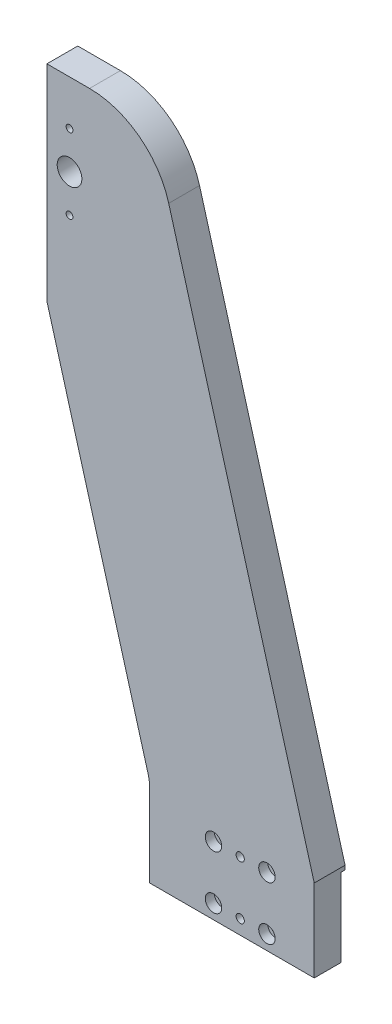
ISO-10303-21;
HEADER;
FILE_DESCRIPTION(('STEP AP214'),'2;1');
FILE_NAME('part.step','',(''),(''),'','','');
FILE_SCHEMA(('AUTOMOTIVE_DESIGN { 1 0 10303 214 1 1 1 1 }'));
ENDSEC;
DATA;
#1=APPLICATION_CONTEXT('core data for automotive mechanical design processes');
#2=APPLICATION_PROTOCOL_DEFINITION('international standard','automotive_design',2000,#1);
#3=PRODUCT_CONTEXT('',#1,'mechanical');
#4=PRODUCT('Part','Part','',(#3));
#5=PRODUCT_RELATED_PRODUCT_CATEGORY('part','',(#4));
#6=PRODUCT_DEFINITION_FORMATION('','',#4);
#7=PRODUCT_DEFINITION_CONTEXT('part definition',#1,'design');
#8=PRODUCT_DEFINITION('design','',#6,#7);
#9=PRODUCT_DEFINITION_SHAPE('','',#8);
#10=(LENGTH_UNIT() NAMED_UNIT(*) SI_UNIT(.MILLI.,.METRE.));
#11=(NAMED_UNIT(*) PLANE_ANGLE_UNIT() SI_UNIT($,.RADIAN.));
#12=(NAMED_UNIT(*) SI_UNIT($,.STERADIAN.) SOLID_ANGLE_UNIT());
#13=UNCERTAINTY_MEASURE_WITH_UNIT(LENGTH_MEASURE(1.E-05),#10,'distance_accuracy_value','');
#14=(GEOMETRIC_REPRESENTATION_CONTEXT(3) GLOBAL_UNCERTAINTY_ASSIGNED_CONTEXT((#13)) GLOBAL_UNIT_ASSIGNED_CONTEXT((#10,
#11,#12)) REPRESENTATION_CONTEXT('',''));
#15=CARTESIAN_POINT('',(0.,0.,0.));
#16=DIRECTION('',(0.,0.,1.));
#17=DIRECTION('',(1.,0.,0.));
#18=AXIS2_PLACEMENT_3D('',#15,#16,#17);
#19=CARTESIAN_POINT('',(0.,0.,15.));
#20=DIRECTION('',(0.,1.,0.));
#21=DIRECTION('',(0.,0.,1.));
#22=AXIS2_PLACEMENT_3D('',#19,#20,#21);
#23=PLANE('',#22);
#24=DIRECTION('',(-1.,0.,0.));
#25=VECTOR('',#24,1.);
#26=CARTESIAN_POINT('',(0.,0.,2.));
#27=LINE('',#26,#25);
#28=CARTESIAN_POINT('',(80.,0.,2.));
#29=VERTEX_POINT('',#28);
#30=CARTESIAN_POINT('',(0.,0.,2.));
#31=VERTEX_POINT('',#30);
#32=EDGE_CURVE('E136',#29,#31,#27,.T.);
#33=ORIENTED_EDGE('',*,*,#32,.F.);
#34=DIRECTION('',(0.,0.,-1.));
#35=VECTOR('',#34,1.);
#36=CARTESIAN_POINT('',(80.,0.,15.));
#37=LINE('',#36,#35);
#38=CARTESIAN_POINT('',(80.,0.,15.));
#39=VERTEX_POINT('',#38);
#40=EDGE_CURVE('E133',#39,#29,#37,.T.);
#41=ORIENTED_EDGE('',*,*,#40,.F.);
#42=DIRECTION('',(1.,0.,0.));
#43=VECTOR('',#42,1.);
#44=CARTESIAN_POINT('',(0.,0.,15.));
#45=LINE('',#44,#43);
#46=CARTESIAN_POINT('',(0.,0.,15.));
#47=VERTEX_POINT('',#46);
#48=EDGE_CURVE('E119',#47,#39,#45,.T.);
#49=ORIENTED_EDGE('',*,*,#48,.F.);
#50=DIRECTION('',(0.,0.,-1.));
#51=VECTOR('',#50,1.);
#52=CARTESIAN_POINT('',(0.,0.,15.));
#53=LINE('',#52,#51);
#54=EDGE_CURVE('E139',#47,#31,#53,.T.);
#55=ORIENTED_EDGE('',*,*,#54,.T.);
#56=EDGE_LOOP('',(#33,#41,#49,#55));
#57=FACE_BOUND('',#56,.T.);
#58=ADVANCED_FACE('F37',(#57),#23,.F.);
#59=CARTESIAN_POINT('',(-29.268839302064,280.,15.));
#60=DIRECTION('',(0.,0.,-1.));
#61=DIRECTION('',(-1.,0.,0.));
#62=AXIS2_PLACEMENT_3D('',#59,#60,#61);
#63=CYLINDRICAL_SURFACE('',#62,40.);
#64=CARTESIAN_POINT('',(-29.268839302064,280.,0.));
#65=DIRECTION('',(0.,0.,1.));
#66=DIRECTION('',(1.,0.,0.));
#67=AXIS2_PLACEMENT_3D('',#64,#65,#66);
#68=CIRCLE('',#67,40.);
#69=CARTESIAN_POINT('',(9.22850948471156,290.86066924224,0.));
#70=VERTEX_POINT('',#69);
#71=CARTESIAN_POINT('',(-29.268839302064,320.,0.));
#72=VERTEX_POINT('',#71);
#73=EDGE_CURVE('E148',#70,#72,#68,.T.);
#74=ORIENTED_EDGE('',*,*,#73,.T.);
#75=DIRECTION('',(0.,0.,-1.));
#76=VECTOR('',#75,1.);
#77=CARTESIAN_POINT('',(-29.268839302064,320.,15.));
#78=LINE('',#77,#76);
#79=CARTESIAN_POINT('',(-29.268839302064,320.,15.));
#80=VERTEX_POINT('',#79);
#81=EDGE_CURVE('E11',#80,#72,#78,.T.);
#82=ORIENTED_EDGE('',*,*,#81,.F.);
#83=CARTESIAN_POINT('',(-29.268839302064,280.,15.));
#84=DIRECTION('',(0.,0.,1.));
#85=DIRECTION('',(1.,0.,0.));
#86=AXIS2_PLACEMENT_3D('',#83,#84,#85);
#87=CIRCLE('',#86,40.);
#88=CARTESIAN_POINT('',(9.22850948471156,290.86066924224,15.));
#89=VERTEX_POINT('',#88);
#90=EDGE_CURVE('E166',#89,#80,#87,.T.);
#91=ORIENTED_EDGE('',*,*,#90,.F.);
#92=DIRECTION('',(0.,0.,-1.));
#93=VECTOR('',#92,1.);
#94=CARTESIAN_POINT('',(9.22850948471156,290.86066924224,15.));
#95=LINE('',#94,#93);
#96=EDGE_CURVE('E144',#89,#70,#95,.T.);
#97=ORIENTED_EDGE('',*,*,#96,.T.);
#98=EDGE_LOOP('',(#74,#82,#91,#97));
#99=FACE_BOUND('',#98,.T.);
#100=ADVANCED_FACE('F39',(#99),#63,.T.);
#101=CARTESIAN_POINT('',(-50.,320.,15.));
#102=DIRECTION('',(0.,-1.,0.));
#103=DIRECTION('',(1.,0.,0.));
#104=AXIS2_PLACEMENT_3D('',#101,#102,#103);
#105=PLANE('',#104);
#106=DIRECTION('',(-1.,0.,0.));
#107=VECTOR('',#106,1.);
#108=CARTESIAN_POINT('',(-50.,320.,0.));
#109=LINE('',#108,#107);
#110=CARTESIAN_POINT('',(-50.,320.,0.));
#111=VERTEX_POINT('',#110);
#112=EDGE_CURVE('E151',#72,#111,#109,.T.);
#113=ORIENTED_EDGE('',*,*,#112,.T.);
#114=DIRECTION('',(0.,0.,-1.));
#115=VECTOR('',#114,1.);
#116=CARTESIAN_POINT('',(-50.,320.,15.));
#117=LINE('',#116,#115);
#118=CARTESIAN_POINT('',(-50.,320.,15.));
#119=VERTEX_POINT('',#118);
#120=EDGE_CURVE('E46',#119,#111,#117,.T.);
#121=ORIENTED_EDGE('',*,*,#120,.F.);
#122=DIRECTION('',(-1.,0.,0.));
#123=VECTOR('',#122,1.);
#124=CARTESIAN_POINT('',(-50.,320.,15.));
#125=LINE('',#124,#123);
#126=EDGE_CURVE('E101',#80,#119,#125,.T.);
#127=ORIENTED_EDGE('',*,*,#126,.F.);
#128=ORIENTED_EDGE('',*,*,#81,.T.);
#129=EDGE_LOOP('',(#113,#121,#127,#128));
#130=FACE_BOUND('',#129,.T.);
#131=ADVANCED_FACE('F353',(#130),#105,.F.);
#132=CARTESIAN_POINT('',(-50.,320.,15.));
#133=DIRECTION('',(1.,0.,0.));
#134=DIRECTION('',(0.,1.,0.));
#135=AXIS2_PLACEMENT_3D('',#132,#133,#134);
#136=PLANE('',#135);
#137=CARTESIAN_POINT('',(-50.,304.,9.));
#138=DIRECTION('',(-1.,0.,0.));
#139=DIRECTION('',(0.,0.,1.));
#140=AXIS2_PLACEMENT_3D('',#137,#138,#139);
#141=CIRCLE('',#140,2.);
#142=CARTESIAN_POINT('',(-50.,304.,11.));
#143=VERTEX_POINT('',#142);
#144=EDGE_CURVE('E231',#143,#143,#141,.T.);
#145=ORIENTED_EDGE('',*,*,#144,.F.);
#146=EDGE_LOOP('',(#145));
#147=FACE_BOUND('',#146,.T.);
#148=CARTESIAN_POINT('',(-50.,256.,9.));
#149=DIRECTION('',(-1.,0.,0.));
#150=DIRECTION('',(0.,0.,1.));
#151=AXIS2_PLACEMENT_3D('',#148,#149,#150);
#152=CIRCLE('',#151,2.);
#153=CARTESIAN_POINT('',(-50.,256.,11.));
#154=VERTEX_POINT('',#153);
#155=EDGE_CURVE('E237',#154,#154,#152,.T.);
#156=ORIENTED_EDGE('',*,*,#155,.F.);
#157=EDGE_LOOP('',(#156));
#158=FACE_BOUND('',#157,.T.);
#159=CARTESIAN_POINT('',(-50.,312.,9.));
#160=DIRECTION('',(-1.,0.,0.));
#161=DIRECTION('',(0.,0.,1.));
#162=AXIS2_PLACEMENT_3D('',#159,#160,#161);
#163=CIRCLE('',#162,1.64999999999998);
#164=CARTESIAN_POINT('',(-50.,312.,10.65));
#165=VERTEX_POINT('',#164);
#166=EDGE_CURVE('E243',#165,#165,#163,.T.);
#167=ORIENTED_EDGE('',*,*,#166,.F.);
#168=EDGE_LOOP('',(#167));
#169=FACE_BOUND('',#168,.T.);
#170=CARTESIAN_POINT('',(-50.,248.,9.00000000000001));
#171=DIRECTION('',(-1.,0.,0.));
#172=DIRECTION('',(0.,0.,1.));
#173=AXIS2_PLACEMENT_3D('',#170,#171,#172);
#174=CIRCLE('',#173,1.64999999999998);
#175=CARTESIAN_POINT('',(-50.,248.,10.65));
#176=VERTEX_POINT('',#175);
#177=EDGE_CURVE('E249',#176,#176,#174,.T.);
#178=ORIENTED_EDGE('',*,*,#177,.F.);
#179=EDGE_LOOP('',(#178));
#180=FACE_BOUND('',#179,.T.);
#181=CARTESIAN_POINT('',(-50.,291.,9.));
#182=DIRECTION('',(-1.,0.,0.));
#183=DIRECTION('',(0.,0.,1.));
#184=AXIS2_PLACEMENT_3D('',#181,#182,#183);
#185=CIRCLE('',#184,1.64999999999998);
#186=CARTESIAN_POINT('',(-50.,291.,10.65));
#187=VERTEX_POINT('',#186);
#188=EDGE_CURVE('E255',#187,#187,#185,.T.);
#189=ORIENTED_EDGE('',*,*,#188,.F.);
#190=EDGE_LOOP('',(#189));
#191=FACE_BOUND('',#190,.T.);
#192=CARTESIAN_POINT('',(-50.,269.,9.00000000000001));
#193=DIRECTION('',(-1.,0.,0.));
#194=DIRECTION('',(0.,0.,1.));
#195=AXIS2_PLACEMENT_3D('',#192,#193,#194);
#196=CIRCLE('',#195,1.64999999999998);
#197=CARTESIAN_POINT('',(-50.,269.,10.65));
#198=VERTEX_POINT('',#197);
#199=EDGE_CURVE('E261',#198,#198,#196,.T.);
#200=ORIENTED_EDGE('',*,*,#199,.F.);
#201=EDGE_LOOP('',(#200));
#202=FACE_BOUND('',#201,.T.);
#203=DIRECTION('',(0.,-1.,0.));
#204=VECTOR('',#203,1.);
#205=CARTESIAN_POINT('',(-50.,320.,0.));
#206=LINE('',#205,#204);
#207=CARTESIAN_POINT('',(-50.,220.,0.));
#208=VERTEX_POINT('',#207);
#209=EDGE_CURVE('E154',#111,#208,#206,.T.);
#210=ORIENTED_EDGE('',*,*,#209,.T.);
#211=DIRECTION('',(0.,0.,-1.));
#212=VECTOR('',#211,1.);
#213=CARTESIAN_POINT('',(-50.,220.,15.));
#214=LINE('',#213,#212);
#215=CARTESIAN_POINT('',(-50.,220.,15.));
#216=VERTEX_POINT('',#215);
#217=EDGE_CURVE('E176',#216,#208,#214,.T.);
#218=ORIENTED_EDGE('',*,*,#217,.F.);
#219=DIRECTION('',(0.,-1.,0.));
#220=VECTOR('',#219,1.);
#221=CARTESIAN_POINT('',(-50.,320.,15.));
#222=LINE('',#221,#220);
#223=EDGE_CURVE('E302',#119,#216,#222,.T.);
#224=ORIENTED_EDGE('',*,*,#223,.F.);
#225=ORIENTED_EDGE('',*,*,#120,.T.);
#226=EDGE_LOOP('',(#210,#218,#224,#225));
#227=FACE_BOUND('',#226,.T.);
#228=ADVANCED_FACE('F356',(#147,#158,#169,#180,#191,#202,#227),#136,.F.);
#229=CARTESIAN_POINT('',(-50.,220.,15.));
#230=DIRECTION('',(0.96243371966939,0.27151673105601,0.));
#231=DIRECTION('',(-0.27151673105601,0.96243371966939,0.));
#232=AXIS2_PLACEMENT_3D('',#229,#230,#231);
#233=PLANE('',#232);
#234=DIRECTION('',(0.27151673105601,-0.96243371966939,0.));
#235=VECTOR('',#234,1.);
#236=CARTESIAN_POINT('',(-50.,220.,0.));
#237=LINE('',#236,#235);
#238=CARTESIAN_POINT('',(-0.751325606612178,45.4303346211202,0.));
#239=VERTEX_POINT('',#238);
#240=EDGE_CURVE('E156',#208,#239,#237,.T.);
#241=ORIENTED_EDGE('',*,*,#240,.T.);
#242=DIRECTION('',(0.,0.,-1.));
#243=VECTOR('',#242,1.);
#244=CARTESIAN_POINT('',(-0.751325606612178,45.4303346211202,15.));
#245=LINE('',#244,#243);
#246=CARTESIAN_POINT('',(-0.751325606612178,45.4303346211202,15.));
#247=VERTEX_POINT('',#246);
#248=EDGE_CURVE('E173',#247,#239,#245,.T.);
#249=ORIENTED_EDGE('',*,*,#248,.F.);
#250=DIRECTION('',(0.27151673105601,-0.96243371966939,0.));
#251=VECTOR('',#250,1.);
#252=CARTESIAN_POINT('',(-50.,220.,15.));
#253=LINE('',#252,#251);
#254=EDGE_CURVE('E304',#216,#247,#253,.T.);
#255=ORIENTED_EDGE('',*,*,#254,.F.);
#256=ORIENTED_EDGE('',*,*,#217,.T.);
#257=EDGE_LOOP('',(#241,#249,#255,#256));
#258=FACE_BOUND('',#257,.T.);
#259=ADVANCED_FACE('F358',(#258),#233,.F.);
#260=CARTESIAN_POINT('',(-20.,40.,15.));
#261=DIRECTION('',(0.,0.,-1.));
#262=DIRECTION('',(-1.,0.,0.));
#263=AXIS2_PLACEMENT_3D('',#260,#261,#262);
#264=CYLINDRICAL_SURFACE('',#263,20.);
#265=CARTESIAN_POINT('',(-20.,40.,0.));
#266=DIRECTION('',(0.,0.,-1.));
#267=DIRECTION('',(1.,0.,0.));
#268=AXIS2_PLACEMENT_3D('',#265,#266,#267);
#269=CIRCLE('',#268,20.);
#270=CARTESIAN_POINT('',(0.,40.,0.));
#271=VERTEX_POINT('',#270);
#272=EDGE_CURVE('E158',#239,#271,#269,.T.);
#273=ORIENTED_EDGE('',*,*,#272,.T.);
#274=DIRECTION('',(0.,0.,-1.));
#275=VECTOR('',#274,1.);
#276=CARTESIAN_POINT('',(0.,40.,15.));
#277=LINE('',#276,#275);
#278=CARTESIAN_POINT('',(0.,40.,15.));
#279=VERTEX_POINT('',#278);
#280=EDGE_CURVE('E170',#279,#271,#277,.T.);
#281=ORIENTED_EDGE('',*,*,#280,.F.);
#282=CARTESIAN_POINT('',(-20.,40.,15.));
#283=DIRECTION('',(0.,0.,-1.));
#284=DIRECTION('',(1.,0.,0.));
#285=AXIS2_PLACEMENT_3D('',#282,#283,#284);
#286=CIRCLE('',#285,20.);
#287=EDGE_CURVE('E306',#247,#279,#286,.T.);
#288=ORIENTED_EDGE('',*,*,#287,.F.);
#289=ORIENTED_EDGE('',*,*,#248,.T.);
#290=EDGE_LOOP('',(#273,#281,#288,#289));
#291=FACE_BOUND('',#290,.T.);
#292=ADVANCED_FACE('F312',(#291),#264,.F.);
#293=CARTESIAN_POINT('',(0.,40.,15.));
#294=DIRECTION('',(1.,0.,0.));
#295=DIRECTION('',(0.,1.,0.));
#296=AXIS2_PLACEMENT_3D('',#293,#294,#295);
#297=PLANE('',#296);
#298=DIRECTION('',(0.,-1.,0.));
#299=VECTOR('',#298,1.);
#300=CARTESIAN_POINT('',(0.,40.,0.));
#301=LINE('',#300,#299);
#302=CARTESIAN_POINT('',(0.,38.,0.));
#303=VERTEX_POINT('',#302);
#304=EDGE_CURVE('E160',#271,#303,#301,.T.);
#305=ORIENTED_EDGE('',*,*,#304,.T.);
#306=DIRECTION('',(0.,0.,-1.));
#307=VECTOR('',#306,1.);
#308=CARTESIAN_POINT('',(0.,38.,2.));
#309=LINE('',#308,#307);
#310=CARTESIAN_POINT('',(0.,38.,2.));
#311=VERTEX_POINT('',#310);
#312=EDGE_CURVE('E54',#311,#303,#309,.T.);
#313=ORIENTED_EDGE('',*,*,#312,.F.);
#314=DIRECTION('',(0.,1.,0.));
#315=VECTOR('',#314,1.);
#316=CARTESIAN_POINT('',(0.,0.,2.));
#317=LINE('',#316,#315);
#318=EDGE_CURVE('E268',#31,#311,#317,.T.);
#319=ORIENTED_EDGE('',*,*,#318,.F.);
#320=ORIENTED_EDGE('',*,*,#54,.F.);
#321=DIRECTION('',(0.,-1.,0.));
#322=VECTOR('',#321,1.);
#323=CARTESIAN_POINT('',(0.,40.,15.));
#324=LINE('',#323,#322);
#325=EDGE_CURVE('E126',#279,#47,#324,.T.);
#326=ORIENTED_EDGE('',*,*,#325,.F.);
#327=ORIENTED_EDGE('',*,*,#280,.T.);
#328=EDGE_LOOP('',(#305,#313,#319,#320,#326,#327));
#329=FACE_BOUND('',#328,.T.);
#330=ADVANCED_FACE('F316',(#329),#297,.F.);
#331=CARTESIAN_POINT('',(80.,0.,15.));
#332=DIRECTION('',(-1.,0.,0.));
#333=DIRECTION('',(0.,-1.,0.));
#334=AXIS2_PLACEMENT_3D('',#331,#332,#333);
#335=PLANE('',#334);
#336=DIRECTION('',(0.,-1.,0.));
#337=VECTOR('',#336,1.);
#338=CARTESIAN_POINT('',(80.,0.,2.));
#339=LINE('',#338,#337);
#340=CARTESIAN_POINT('',(80.,38.,2.));
#341=VERTEX_POINT('',#340);
#342=EDGE_CURVE('E274',#341,#29,#339,.T.);
#343=ORIENTED_EDGE('',*,*,#342,.F.);
#344=DIRECTION('',(0.,0.,-1.));
#345=VECTOR('',#344,1.);
#346=CARTESIAN_POINT('',(80.,38.,2.));
#347=LINE('',#346,#345);
#348=CARTESIAN_POINT('',(80.,38.,0.));
#349=VERTEX_POINT('',#348);
#350=EDGE_CURVE('E279',#341,#349,#347,.T.);
#351=ORIENTED_EDGE('',*,*,#350,.T.);
#352=DIRECTION('',(0.,1.,0.));
#353=VECTOR('',#352,1.);
#354=CARTESIAN_POINT('',(80.,0.,0.));
#355=LINE('',#354,#353);
#356=CARTESIAN_POINT('',(80.,40.,0.));
#357=VERTEX_POINT('',#356);
#358=EDGE_CURVE('E163',#349,#357,#355,.T.);
#359=ORIENTED_EDGE('',*,*,#358,.T.);
#360=DIRECTION('',(0.,0.,-1.));
#361=VECTOR('',#360,1.);
#362=CARTESIAN_POINT('',(80.,40.,15.));
#363=LINE('',#362,#361);
#364=CARTESIAN_POINT('',(80.,40.,15.));
#365=VERTEX_POINT('',#364);
#366=EDGE_CURVE('E140',#365,#357,#363,.T.);
#367=ORIENTED_EDGE('',*,*,#366,.F.);
#368=DIRECTION('',(0.,1.,0.));
#369=VECTOR('',#368,1.);
#370=CARTESIAN_POINT('',(80.,0.,15.));
#371=LINE('',#370,#369);
#372=EDGE_CURVE('E123',#39,#365,#371,.T.);
#373=ORIENTED_EDGE('',*,*,#372,.F.);
#374=ORIENTED_EDGE('',*,*,#40,.T.);
#375=EDGE_LOOP('',(#343,#351,#359,#367,#373,#374));
#376=FACE_BOUND('',#375,.T.);
#377=ADVANCED_FACE('F142',(#376),#335,.F.);
#378=CARTESIAN_POINT('',(9.22850948471156,290.86066924224,15.));
#379=DIRECTION('',(-0.96243371966939,-0.27151673105601,0.));
#380=DIRECTION('',(0.27151673105601,-0.96243371966939,0.));
#381=AXIS2_PLACEMENT_3D('',#378,#379,#380);
#382=PLANE('',#381);
#383=DIRECTION('',(-0.27151673105601,0.96243371966939,0.));
#384=VECTOR('',#383,1.);
#385=CARTESIAN_POINT('',(9.22850948471156,290.86066924224,0.));
#386=LINE('',#385,#384);
#387=EDGE_CURVE('E93',#357,#70,#386,.T.);
#388=ORIENTED_EDGE('',*,*,#387,.T.);
#389=ORIENTED_EDGE('',*,*,#96,.F.);
#390=DIRECTION('',(-0.27151673105601,0.96243371966939,0.));
#391=VECTOR('',#390,1.);
#392=CARTESIAN_POINT('',(9.22850948471156,290.86066924224,15.));
#393=LINE('',#392,#391);
#394=EDGE_CURVE('E63',#365,#89,#393,.T.);
#395=ORIENTED_EDGE('',*,*,#394,.F.);
#396=ORIENTED_EDGE('',*,*,#366,.T.);
#397=EDGE_LOOP('',(#388,#389,#395,#396));
#398=FACE_BOUND('',#397,.T.);
#399=ADVANCED_FACE('F347',(#398),#382,.F.);
#400=CARTESIAN_POINT('',(-29.268839302064,280.,15.));
#401=DIRECTION('',(0.,0.,1.));
#402=DIRECTION('',(1.,0.,0.));
#403=AXIS2_PLACEMENT_3D('',#400,#401,#402);
#404=PLANE('',#403);
#405=CARTESIAN_POINT('',(57.,33.,15.));
#406=DIRECTION('',(0.,0.,1.));
#407=DIRECTION('',(1.,0.,0.));
#408=AXIS2_PLACEMENT_3D('',#405,#406,#407);
#409=CIRCLE('',#408,4.);
#410=CARTESIAN_POINT('',(61.,33.,15.));
#411=VERTEX_POINT('',#410);
#412=EDGE_CURVE('E526',#411,#411,#409,.T.);
#413=ORIENTED_EDGE('',*,*,#412,.F.);
#414=EDGE_LOOP('',(#413));
#415=FACE_BOUND('',#414,.T.);
#416=CARTESIAN_POINT('',(31.,7.,15.));
#417=DIRECTION('',(0.,0.,1.));
#418=DIRECTION('',(1.,0.,0.));
#419=AXIS2_PLACEMENT_3D('',#416,#417,#418);
#420=CIRCLE('',#419,4.);
#421=CARTESIAN_POINT('',(35.,7.,15.));
#422=VERTEX_POINT('',#421);
#423=EDGE_CURVE('E205',#422,#422,#420,.T.);
#424=ORIENTED_EDGE('',*,*,#423,.F.);
#425=EDGE_LOOP('',(#424));
#426=FACE_BOUND('',#425,.T.);
#427=CARTESIAN_POINT('',(31.,33.,15.));
#428=DIRECTION('',(0.,0.,1.));
#429=DIRECTION('',(1.,0.,0.));
#430=AXIS2_PLACEMENT_3D('',#427,#428,#429);
#431=CIRCLE('',#430,4.);
#432=CARTESIAN_POINT('',(35.,33.,15.));
#433=VERTEX_POINT('',#432);
#434=EDGE_CURVE('E192',#433,#433,#431,.T.);
#435=ORIENTED_EDGE('',*,*,#434,.F.);
#436=EDGE_LOOP('',(#435));
#437=FACE_BOUND('',#436,.T.);
#438=CARTESIAN_POINT('',(57.,7.,15.));
#439=DIRECTION('',(0.,0.,1.));
#440=DIRECTION('',(1.,0.,0.));
#441=AXIS2_PLACEMENT_3D('',#438,#439,#440);
#442=CIRCLE('',#441,4.);
#443=CARTESIAN_POINT('',(61.,7.,15.));
#444=VERTEX_POINT('',#443);
#445=EDGE_CURVE('E188',#444,#444,#442,.T.);
#446=ORIENTED_EDGE('',*,*,#445,.F.);
#447=EDGE_LOOP('',(#446));
#448=FACE_BOUND('',#447,.T.);
#449=CARTESIAN_POINT('',(44.,33.,15.));
#450=DIRECTION('',(0.,0.,1.));
#451=DIRECTION('',(1.,0.,0.));
#452=AXIS2_PLACEMENT_3D('',#449,#450,#451);
#453=CIRCLE('',#452,1.99999999999999);
#454=CARTESIAN_POINT('',(46.,33.,15.));
#455=VERTEX_POINT('',#454);
#456=EDGE_CURVE('E184',#455,#455,#453,.T.);
#457=ORIENTED_EDGE('',*,*,#456,.F.);
#458=EDGE_LOOP('',(#457));
#459=FACE_BOUND('',#458,.T.);
#460=CARTESIAN_POINT('',(44.,7.,15.));
#461=DIRECTION('',(0.,0.,1.));
#462=DIRECTION('',(1.,0.,0.));
#463=AXIS2_PLACEMENT_3D('',#460,#461,#462);
#464=CIRCLE('',#463,1.99999999999999);
#465=CARTESIAN_POINT('',(46.,7.,15.));
#466=VERTEX_POINT('',#465);
#467=EDGE_CURVE('E225',#466,#466,#464,.T.);
#468=ORIENTED_EDGE('',*,*,#467,.F.);
#469=EDGE_LOOP('',(#468));
#470=FACE_BOUND('',#469,.T.);
#471=CARTESIAN_POINT('',(-39.,298.25,15.));
#472=DIRECTION('',(0.,0.,1.));
#473=DIRECTION('',(1.,0.,0.));
#474=AXIS2_PLACEMENT_3D('',#471,#472,#473);
#475=CIRCLE('',#474,1.65);
#476=CARTESIAN_POINT('',(-37.35,298.25,15.));
#477=VERTEX_POINT('',#476);
#478=EDGE_CURVE('E282',#477,#477,#475,.T.);
#479=ORIENTED_EDGE('',*,*,#478,.F.);
#480=EDGE_LOOP('',(#479));
#481=FACE_BOUND('',#480,.T.);
#482=CARTESIAN_POINT('',(-39.,261.75,15.));
#483=DIRECTION('',(0.,0.,1.));
#484=DIRECTION('',(1.,0.,0.));
#485=AXIS2_PLACEMENT_3D('',#482,#483,#484);
#486=CIRCLE('',#485,1.65);
#487=CARTESIAN_POINT('',(-37.35,261.75,15.));
#488=VERTEX_POINT('',#487);
#489=EDGE_CURVE('E289',#488,#488,#486,.T.);
#490=ORIENTED_EDGE('',*,*,#489,.F.);
#491=EDGE_LOOP('',(#490));
#492=FACE_BOUND('',#491,.T.);
#493=CARTESIAN_POINT('',(-39.,280.,15.));
#494=DIRECTION('',(0.,0.,-1.));
#495=DIRECTION('',(-1.,0.,0.));
#496=AXIS2_PLACEMENT_3D('',#493,#494,#495);
#497=CIRCLE('',#496,6.);
#498=CARTESIAN_POINT('',(-45.,280.,15.));
#499=VERTEX_POINT('',#498);
#500=EDGE_CURVE('E152',#499,#499,#497,.T.);
#501=ORIENTED_EDGE('',*,*,#500,.T.);
#502=EDGE_LOOP('',(#501));
#503=FACE_BOUND('',#502,.T.);
#504=ORIENTED_EDGE('',*,*,#90,.T.);
#505=ORIENTED_EDGE('',*,*,#126,.T.);
#506=ORIENTED_EDGE('',*,*,#223,.T.);
#507=ORIENTED_EDGE('',*,*,#254,.T.);
#508=ORIENTED_EDGE('',*,*,#287,.T.);
#509=ORIENTED_EDGE('',*,*,#325,.T.);
#510=ORIENTED_EDGE('',*,*,#48,.T.);
#511=ORIENTED_EDGE('',*,*,#372,.T.);
#512=ORIENTED_EDGE('',*,*,#394,.T.);
#513=EDGE_LOOP('',(#504,#505,#506,#507,#508,#509,#510,#511,#512));
#514=FACE_BOUND('',#513,.T.);
#515=ADVANCED_FACE('F121',(#415,#426,#437,#448,#459,#470,#481,#492,#503,#514),#404,.T.);
#516=CARTESIAN_POINT('',(-29.268839302064,280.,0.));
#517=DIRECTION('',(0.,0.,1.));
#518=DIRECTION('',(1.,0.,0.));
#519=AXIS2_PLACEMENT_3D('',#516,#517,#518);
#520=PLANE('',#519);
#521=CARTESIAN_POINT('',(-39.,280.,0.));
#522=DIRECTION('',(0.,0.,-1.));
#523=DIRECTION('',(-1.,0.,0.));
#524=AXIS2_PLACEMENT_3D('',#521,#522,#523);
#525=CIRCLE('',#524,6.);
#526=CARTESIAN_POINT('',(-45.,280.,0.));
#527=VERTEX_POINT('',#526);
#528=EDGE_CURVE('E295',#527,#527,#525,.T.);
#529=ORIENTED_EDGE('',*,*,#528,.F.);
#530=EDGE_LOOP('',(#529));
#531=FACE_BOUND('',#530,.T.);
#532=ORIENTED_EDGE('',*,*,#358,.F.);
#533=DIRECTION('',(1.,0.,0.));
#534=VECTOR('',#533,1.);
#535=CARTESIAN_POINT('',(0.,38.,0.));
#536=LINE('',#535,#534);
#537=EDGE_CURVE('E267',#303,#349,#536,.T.);
#538=ORIENTED_EDGE('',*,*,#537,.F.);
#539=ORIENTED_EDGE('',*,*,#304,.F.);
#540=ORIENTED_EDGE('',*,*,#272,.F.);
#541=ORIENTED_EDGE('',*,*,#240,.F.);
#542=ORIENTED_EDGE('',*,*,#209,.F.);
#543=ORIENTED_EDGE('',*,*,#112,.F.);
#544=ORIENTED_EDGE('',*,*,#73,.F.);
#545=ORIENTED_EDGE('',*,*,#387,.F.);
#546=EDGE_LOOP('',(#532,#538,#539,#540,#541,#542,#543,#544,#545));
#547=FACE_BOUND('',#546,.T.);
#548=ADVANCED_FACE('F344',(#531,#547),#520,.F.);
#549=CARTESIAN_POINT('',(-39.,280.,15.));
#550=DIRECTION('',(0.,0.,-1.));
#551=DIRECTION('',(-1.,0.,0.));
#552=AXIS2_PLACEMENT_3D('',#549,#550,#551);
#553=CYLINDRICAL_SURFACE('',#552,6.);
#554=ORIENTED_EDGE('',*,*,#500,.F.);
#555=EDGE_LOOP('',(#554));
#556=FACE_BOUND('',#555,.T.);
#557=ORIENTED_EDGE('',*,*,#528,.T.);
#558=EDGE_LOOP('',(#557));
#559=FACE_BOUND('',#558,.T.);
#560=ADVANCED_FACE('F390',(#556,#559),#553,.F.);
#561=CARTESIAN_POINT('',(-39.,261.75,8.));
#562=DIRECTION('',(0.,0.,1.));
#563=DIRECTION('',(1.,0.,0.));
#564=AXIS2_PLACEMENT_3D('',#561,#562,#563);
#565=CONICAL_SURFACE('',#564,1.65,1.02974425867665);
#566=CARTESIAN_POINT('',(-39.,261.75,7.00857997860453));
#567=VERTEX_POINT('',#566);
#568=VERTEX_LOOP('',#567);
#569=FACE_BOUND('',#568,.T.);
#570=CARTESIAN_POINT('',(-39.,261.75,8.));
#571=DIRECTION('',(0.,0.,1.));
#572=DIRECTION('',(1.,0.,0.));
#573=AXIS2_PLACEMENT_3D('',#570,#571,#572);
#574=CIRCLE('',#573,1.65);
#575=CARTESIAN_POINT('',(-37.35,261.75,8.));
#576=VERTEX_POINT('',#575);
#577=EDGE_CURVE('E292',#576,#576,#574,.T.);
#578=ORIENTED_EDGE('',*,*,#577,.T.);
#579=EDGE_LOOP('',(#578));
#580=FACE_BOUND('',#579,.T.);
#581=ADVANCED_FACE('F395',(#569,#580),#565,.F.);
#582=CARTESIAN_POINT('',(-39.,261.75,15.));
#583=DIRECTION('',(0.,0.,1.));
#584=DIRECTION('',(1.,0.,0.));
#585=AXIS2_PLACEMENT_3D('',#582,#583,#584);
#586=CYLINDRICAL_SURFACE('',#585,1.65);
#587=ORIENTED_EDGE('',*,*,#577,.F.);
#588=EDGE_LOOP('',(#587));
#589=FACE_BOUND('',#588,.T.);
#590=ORIENTED_EDGE('',*,*,#489,.T.);
#591=EDGE_LOOP('',(#590));
#592=FACE_BOUND('',#591,.T.);
#593=ADVANCED_FACE('F399',(#589,#592),#586,.F.);
#594=CARTESIAN_POINT('',(-39.,298.25,8.));
#595=DIRECTION('',(0.,0.,1.));
#596=DIRECTION('',(1.,0.,0.));
#597=AXIS2_PLACEMENT_3D('',#594,#595,#596);
#598=CONICAL_SURFACE('',#597,1.65,1.02974425867665);
#599=CARTESIAN_POINT('',(-39.,298.25,7.00857997860453));
#600=VERTEX_POINT('',#599);
#601=VERTEX_LOOP('',#600);
#602=FACE_BOUND('',#601,.T.);
#603=CARTESIAN_POINT('',(-39.,298.25,8.));
#604=DIRECTION('',(0.,0.,1.));
#605=DIRECTION('',(1.,0.,0.));
#606=AXIS2_PLACEMENT_3D('',#603,#604,#605);
#607=CIRCLE('',#606,1.65);
#608=CARTESIAN_POINT('',(-37.35,298.25,8.));
#609=VERTEX_POINT('',#608);
#610=EDGE_CURVE('E286',#609,#609,#607,.T.);
#611=ORIENTED_EDGE('',*,*,#610,.T.);
#612=EDGE_LOOP('',(#611));
#613=FACE_BOUND('',#612,.T.);
#614=ADVANCED_FACE('F403',(#602,#613),#598,.F.);
#615=CARTESIAN_POINT('',(-39.,298.25,15.));
#616=DIRECTION('',(0.,0.,1.));
#617=DIRECTION('',(1.,0.,0.));
#618=AXIS2_PLACEMENT_3D('',#615,#616,#617);
#619=CYLINDRICAL_SURFACE('',#618,1.65);
#620=ORIENTED_EDGE('',*,*,#610,.F.);
#621=EDGE_LOOP('',(#620));
#622=FACE_BOUND('',#621,.T.);
#623=ORIENTED_EDGE('',*,*,#478,.T.);
#624=EDGE_LOOP('',(#623));
#625=FACE_BOUND('',#624,.T.);
#626=ADVANCED_FACE('F407',(#622,#625),#619,.F.);
#627=CARTESIAN_POINT('',(0.,38.,2.));
#628=DIRECTION('',(0.,1.,0.));
#629=DIRECTION('',(-1.,0.,0.));
#630=AXIS2_PLACEMENT_3D('',#627,#628,#629);
#631=PLANE('',#630);
#632=ORIENTED_EDGE('',*,*,#537,.T.);
#633=ORIENTED_EDGE('',*,*,#350,.F.);
#634=DIRECTION('',(1.,0.,0.));
#635=VECTOR('',#634,1.);
#636=CARTESIAN_POINT('',(0.,38.,2.));
#637=LINE('',#636,#635);
#638=EDGE_CURVE('E271',#311,#341,#637,.T.);
#639=ORIENTED_EDGE('',*,*,#638,.F.);
#640=ORIENTED_EDGE('',*,*,#312,.T.);
#641=EDGE_LOOP('',(#632,#633,#639,#640));
#642=FACE_BOUND('',#641,.T.);
#643=ADVANCED_FACE('F340',(#642),#631,.F.);
#644=CARTESIAN_POINT('',(0.,0.,2.));
#645=DIRECTION('',(0.,0.,-1.));
#646=DIRECTION('',(-1.,0.,0.));
#647=AXIS2_PLACEMENT_3D('',#644,#645,#646);
#648=PLANE('',#647);
#649=CARTESIAN_POINT('',(57.,33.,2.));
#650=DIRECTION('',(0.,0.,-1.));
#651=DIRECTION('',(-1.,0.,0.));
#652=AXIS2_PLACEMENT_3D('',#649,#650,#651);
#653=CIRCLE('',#652,2.25);
#654=CARTESIAN_POINT('',(54.75,33.,2.));
#655=VERTEX_POINT('',#654);
#656=EDGE_CURVE('E41',#655,#655,#653,.T.);
#657=ORIENTED_EDGE('',*,*,#656,.F.);
#658=EDGE_LOOP('',(#657));
#659=FACE_BOUND('',#658,.T.);
#660=CARTESIAN_POINT('',(31.,7.,2.));
#661=DIRECTION('',(0.,0.,-1.));
#662=DIRECTION('',(-1.,0.,0.));
#663=AXIS2_PLACEMENT_3D('',#660,#661,#662);
#664=CIRCLE('',#663,2.25);
#665=CARTESIAN_POINT('',(28.75,7.,2.));
#666=VERTEX_POINT('',#665);
#667=EDGE_CURVE('E190',#666,#666,#664,.T.);
#668=ORIENTED_EDGE('',*,*,#667,.F.);
#669=EDGE_LOOP('',(#668));
#670=FACE_BOUND('',#669,.T.);
#671=CARTESIAN_POINT('',(31.,33.,2.));
#672=DIRECTION('',(0.,0.,-1.));
#673=DIRECTION('',(-1.,0.,0.));
#674=AXIS2_PLACEMENT_3D('',#671,#672,#673);
#675=CIRCLE('',#674,2.25);
#676=CARTESIAN_POINT('',(28.75,33.,2.));
#677=VERTEX_POINT('',#676);
#678=EDGE_CURVE('E186',#677,#677,#675,.T.);
#679=ORIENTED_EDGE('',*,*,#678,.F.);
#680=EDGE_LOOP('',(#679));
#681=FACE_BOUND('',#680,.T.);
#682=CARTESIAN_POINT('',(57.,7.,2.));
#683=DIRECTION('',(0.,0.,-1.));
#684=DIRECTION('',(-1.,0.,0.));
#685=AXIS2_PLACEMENT_3D('',#682,#683,#684);
#686=CIRCLE('',#685,2.25);
#687=CARTESIAN_POINT('',(54.75,7.,2.));
#688=VERTEX_POINT('',#687);
#689=EDGE_CURVE('E181',#688,#688,#686,.T.);
#690=ORIENTED_EDGE('',*,*,#689,.F.);
#691=EDGE_LOOP('',(#690));
#692=FACE_BOUND('',#691,.T.);
#693=CARTESIAN_POINT('',(44.,33.,2.));
#694=DIRECTION('',(0.,0.,-1.));
#695=DIRECTION('',(-1.,0.,0.));
#696=AXIS2_PLACEMENT_3D('',#693,#694,#695);
#697=CIRCLE('',#696,1.99999999999999);
#698=CARTESIAN_POINT('',(42.,33.,2.));
#699=VERTEX_POINT('',#698);
#700=EDGE_CURVE('E222',#699,#699,#697,.T.);
#701=ORIENTED_EDGE('',*,*,#700,.F.);
#702=EDGE_LOOP('',(#701));
#703=FACE_BOUND('',#702,.T.);
#704=CARTESIAN_POINT('',(44.,7.,2.));
#705=DIRECTION('',(0.,0.,-1.));
#706=DIRECTION('',(-1.,0.,0.));
#707=AXIS2_PLACEMENT_3D('',#704,#705,#706);
#708=CIRCLE('',#707,1.99999999999999);
#709=CARTESIAN_POINT('',(42.,7.,2.));
#710=VERTEX_POINT('',#709);
#711=EDGE_CURVE('E228',#710,#710,#708,.T.);
#712=ORIENTED_EDGE('',*,*,#711,.F.);
#713=EDGE_LOOP('',(#712));
#714=FACE_BOUND('',#713,.T.);
#715=ORIENTED_EDGE('',*,*,#318,.T.);
#716=ORIENTED_EDGE('',*,*,#638,.T.);
#717=ORIENTED_EDGE('',*,*,#342,.T.);
#718=ORIENTED_EDGE('',*,*,#32,.T.);
#719=EDGE_LOOP('',(#715,#716,#717,#718));
#720=FACE_BOUND('',#719,.T.);
#721=ADVANCED_FACE('F342',(#659,#670,#681,#692,#703,#714,#720),#648,.T.);
#722=CARTESIAN_POINT('',(-35.,269.,9.00000000000001));
#723=DIRECTION('',(-1.,0.,0.));
#724=DIRECTION('',(0.,0.,1.));
#725=AXIS2_PLACEMENT_3D('',#722,#723,#724);
#726=CONICAL_SURFACE('',#725,1.64999999999998,1.02974425867665);
#727=CARTESIAN_POINT('',(-34.0085799786046,269.,9.00000000000001));
#728=VERTEX_POINT('',#727);
#729=VERTEX_LOOP('',#728);
#730=FACE_BOUND('',#729,.T.);
#731=CARTESIAN_POINT('',(-35.,269.,9.00000000000001));
#732=DIRECTION('',(-1.,0.,0.));
#733=DIRECTION('',(0.,0.,1.));
#734=AXIS2_PLACEMENT_3D('',#731,#732,#733);
#735=CIRCLE('',#734,1.64999999999998);
#736=CARTESIAN_POINT('',(-35.,269.,10.65));
#737=VERTEX_POINT('',#736);
#738=EDGE_CURVE('E264',#737,#737,#735,.T.);
#739=ORIENTED_EDGE('',*,*,#738,.T.);
#740=EDGE_LOOP('',(#739));
#741=FACE_BOUND('',#740,.T.);
#742=ADVANCED_FACE('F416',(#730,#741),#726,.F.);
#743=CARTESIAN_POINT('',(-50.,269.,9.00000000000001));
#744=DIRECTION('',(-1.,0.,0.));
#745=DIRECTION('',(0.,0.,1.));
#746=AXIS2_PLACEMENT_3D('',#743,#744,#745);
#747=CYLINDRICAL_SURFACE('',#746,1.64999999999998);
#748=ORIENTED_EDGE('',*,*,#738,.F.);
#749=EDGE_LOOP('',(#748));
#750=FACE_BOUND('',#749,.T.);
#751=ORIENTED_EDGE('',*,*,#199,.T.);
#752=EDGE_LOOP('',(#751));
#753=FACE_BOUND('',#752,.T.);
#754=ADVANCED_FACE('F420',(#750,#753),#747,.F.);
#755=CARTESIAN_POINT('',(-35.,291.,9.));
#756=DIRECTION('',(-1.,0.,0.));
#757=DIRECTION('',(0.,0.,1.));
#758=AXIS2_PLACEMENT_3D('',#755,#756,#757);
#759=CONICAL_SURFACE('',#758,1.64999999999998,1.02974425867665);
#760=CARTESIAN_POINT('',(-34.0085799786046,291.,9.));
#761=VERTEX_POINT('',#760);
#762=VERTEX_LOOP('',#761);
#763=FACE_BOUND('',#762,.T.);
#764=CARTESIAN_POINT('',(-35.,291.,9.));
#765=DIRECTION('',(-1.,0.,0.));
#766=DIRECTION('',(0.,0.,1.));
#767=AXIS2_PLACEMENT_3D('',#764,#765,#766);
#768=CIRCLE('',#767,1.64999999999998);
#769=CARTESIAN_POINT('',(-35.,291.,10.65));
#770=VERTEX_POINT('',#769);
#771=EDGE_CURVE('E258',#770,#770,#768,.T.);
#772=ORIENTED_EDGE('',*,*,#771,.T.);
#773=EDGE_LOOP('',(#772));
#774=FACE_BOUND('',#773,.T.);
#775=ADVANCED_FACE('F423',(#763,#774),#759,.F.);
#776=CARTESIAN_POINT('',(-50.,291.,9.));
#777=DIRECTION('',(-1.,0.,0.));
#778=DIRECTION('',(0.,0.,1.));
#779=AXIS2_PLACEMENT_3D('',#776,#777,#778);
#780=CYLINDRICAL_SURFACE('',#779,1.64999999999998);
#781=ORIENTED_EDGE('',*,*,#771,.F.);
#782=EDGE_LOOP('',(#781));
#783=FACE_BOUND('',#782,.T.);
#784=ORIENTED_EDGE('',*,*,#188,.T.);
#785=EDGE_LOOP('',(#784));
#786=FACE_BOUND('',#785,.T.);
#787=ADVANCED_FACE('F427',(#783,#786),#780,.F.);
#788=CARTESIAN_POINT('',(-35.,248.,9.00000000000001));
#789=DIRECTION('',(-1.,0.,0.));
#790=DIRECTION('',(0.,0.,1.));
#791=AXIS2_PLACEMENT_3D('',#788,#789,#790);
#792=CONICAL_SURFACE('',#791,1.64999999999998,1.02974425867665);
#793=CARTESIAN_POINT('',(-34.0085799786046,248.,9.00000000000001));
#794=VERTEX_POINT('',#793);
#795=VERTEX_LOOP('',#794);
#796=FACE_BOUND('',#795,.T.);
#797=CARTESIAN_POINT('',(-35.,248.,9.00000000000001));
#798=DIRECTION('',(-1.,0.,0.));
#799=DIRECTION('',(0.,0.,1.));
#800=AXIS2_PLACEMENT_3D('',#797,#798,#799);
#801=CIRCLE('',#800,1.64999999999998);
#802=CARTESIAN_POINT('',(-35.,248.,10.65));
#803=VERTEX_POINT('',#802);
#804=EDGE_CURVE('E252',#803,#803,#801,.T.);
#805=ORIENTED_EDGE('',*,*,#804,.T.);
#806=EDGE_LOOP('',(#805));
#807=FACE_BOUND('',#806,.T.);
#808=ADVANCED_FACE('F431',(#796,#807),#792,.F.);
#809=CARTESIAN_POINT('',(-50.,248.,9.00000000000001));
#810=DIRECTION('',(-1.,0.,0.));
#811=DIRECTION('',(0.,0.,1.));
#812=AXIS2_PLACEMENT_3D('',#809,#810,#811);
#813=CYLINDRICAL_SURFACE('',#812,1.64999999999998);
#814=ORIENTED_EDGE('',*,*,#804,.F.);
#815=EDGE_LOOP('',(#814));
#816=FACE_BOUND('',#815,.T.);
#817=ORIENTED_EDGE('',*,*,#177,.T.);
#818=EDGE_LOOP('',(#817));
#819=FACE_BOUND('',#818,.T.);
#820=ADVANCED_FACE('F435',(#816,#819),#813,.F.);
#821=CARTESIAN_POINT('',(-35.,312.,9.));
#822=DIRECTION('',(-1.,0.,0.));
#823=DIRECTION('',(0.,0.,1.));
#824=AXIS2_PLACEMENT_3D('',#821,#822,#823);
#825=CONICAL_SURFACE('',#824,1.64999999999998,1.02974425867665);
#826=CARTESIAN_POINT('',(-34.0085799786046,312.,9.));
#827=VERTEX_POINT('',#826);
#828=VERTEX_LOOP('',#827);
#829=FACE_BOUND('',#828,.T.);
#830=CARTESIAN_POINT('',(-35.,312.,9.));
#831=DIRECTION('',(-1.,0.,0.));
#832=DIRECTION('',(0.,0.,1.));
#833=AXIS2_PLACEMENT_3D('',#830,#831,#832);
#834=CIRCLE('',#833,1.64999999999998);
#835=CARTESIAN_POINT('',(-35.,312.,10.65));
#836=VERTEX_POINT('',#835);
#837=EDGE_CURVE('E246',#836,#836,#834,.T.);
#838=ORIENTED_EDGE('',*,*,#837,.T.);
#839=EDGE_LOOP('',(#838));
#840=FACE_BOUND('',#839,.T.);
#841=ADVANCED_FACE('F439',(#829,#840),#825,.F.);
#842=CARTESIAN_POINT('',(-50.,312.,9.));
#843=DIRECTION('',(-1.,0.,0.));
#844=DIRECTION('',(0.,0.,1.));
#845=AXIS2_PLACEMENT_3D('',#842,#843,#844);
#846=CYLINDRICAL_SURFACE('',#845,1.64999999999998);
#847=ORIENTED_EDGE('',*,*,#837,.F.);
#848=EDGE_LOOP('',(#847));
#849=FACE_BOUND('',#848,.T.);
#850=ORIENTED_EDGE('',*,*,#166,.T.);
#851=EDGE_LOOP('',(#850));
#852=FACE_BOUND('',#851,.T.);
#853=ADVANCED_FACE('F443',(#849,#852),#846,.F.);
#854=CARTESIAN_POINT('',(-33.,256.,9.));
#855=DIRECTION('',(-1.,0.,0.));
#856=DIRECTION('',(0.,0.,1.));
#857=AXIS2_PLACEMENT_3D('',#854,#855,#856);
#858=CONICAL_SURFACE('',#857,2.,1.02974425867665);
#859=CARTESIAN_POINT('',(-31.7982787619449,256.,9.));
#860=VERTEX_POINT('',#859);
#861=VERTEX_LOOP('',#860);
#862=FACE_BOUND('',#861,.T.);
#863=CARTESIAN_POINT('',(-33.,256.,9.));
#864=DIRECTION('',(-1.,0.,0.));
#865=DIRECTION('',(0.,0.,1.));
#866=AXIS2_PLACEMENT_3D('',#863,#864,#865);
#867=CIRCLE('',#866,2.);
#868=CARTESIAN_POINT('',(-33.,256.,11.));
#869=VERTEX_POINT('',#868);
#870=EDGE_CURVE('E240',#869,#869,#867,.T.);
#871=ORIENTED_EDGE('',*,*,#870,.T.);
#872=EDGE_LOOP('',(#871));
#873=FACE_BOUND('',#872,.T.);
#874=ADVANCED_FACE('F447',(#862,#873),#858,.F.);
#875=CARTESIAN_POINT('',(-50.,256.,9.));
#876=DIRECTION('',(-1.,0.,0.));
#877=DIRECTION('',(0.,0.,1.));
#878=AXIS2_PLACEMENT_3D('',#875,#876,#877);
#879=CYLINDRICAL_SURFACE('',#878,2.);
#880=ORIENTED_EDGE('',*,*,#870,.F.);
#881=EDGE_LOOP('',(#880));
#882=FACE_BOUND('',#881,.T.);
#883=ORIENTED_EDGE('',*,*,#155,.T.);
#884=EDGE_LOOP('',(#883));
#885=FACE_BOUND('',#884,.T.);
#886=ADVANCED_FACE('F451',(#882,#885),#879,.F.);
#887=CARTESIAN_POINT('',(-33.,304.,9.));
#888=DIRECTION('',(-1.,0.,0.));
#889=DIRECTION('',(0.,0.,1.));
#890=AXIS2_PLACEMENT_3D('',#887,#888,#889);
#891=CONICAL_SURFACE('',#890,2.,1.02974425867666);
#892=CARTESIAN_POINT('',(-31.7982787619449,304.,9.));
#893=VERTEX_POINT('',#892);
#894=VERTEX_LOOP('',#893);
#895=FACE_BOUND('',#894,.T.);
#896=CARTESIAN_POINT('',(-33.,304.,9.));
#897=DIRECTION('',(-1.,0.,0.));
#898=DIRECTION('',(0.,0.,1.));
#899=AXIS2_PLACEMENT_3D('',#896,#897,#898);
#900=CIRCLE('',#899,2.);
#901=CARTESIAN_POINT('',(-33.,304.,11.));
#902=VERTEX_POINT('',#901);
#903=EDGE_CURVE('E234',#902,#902,#900,.T.);
#904=ORIENTED_EDGE('',*,*,#903,.T.);
#905=EDGE_LOOP('',(#904));
#906=FACE_BOUND('',#905,.T.);
#907=ADVANCED_FACE('F455',(#895,#906),#891,.F.);
#908=CARTESIAN_POINT('',(-50.,304.,9.));
#909=DIRECTION('',(-1.,0.,0.));
#910=DIRECTION('',(0.,0.,1.));
#911=AXIS2_PLACEMENT_3D('',#908,#909,#910);
#912=CYLINDRICAL_SURFACE('',#911,2.);
#913=ORIENTED_EDGE('',*,*,#903,.F.);
#914=EDGE_LOOP('',(#913));
#915=FACE_BOUND('',#914,.T.);
#916=ORIENTED_EDGE('',*,*,#144,.T.);
#917=EDGE_LOOP('',(#916));
#918=FACE_BOUND('',#917,.T.);
#919=ADVANCED_FACE('F459',(#915,#918),#912,.F.);
#920=CARTESIAN_POINT('',(44.,7.,15.));
#921=DIRECTION('',(0.,0.,1.));
#922=DIRECTION('',(1.,0.,0.));
#923=AXIS2_PLACEMENT_3D('',#920,#921,#922);
#924=CYLINDRICAL_SURFACE('',#923,1.99999999999999);
#925=ORIENTED_EDGE('',*,*,#711,.T.);
#926=EDGE_LOOP('',(#925));
#927=FACE_BOUND('',#926,.T.);
#928=ORIENTED_EDGE('',*,*,#467,.T.);
#929=EDGE_LOOP('',(#928));
#930=FACE_BOUND('',#929,.T.);
#931=ADVANCED_FACE('F463',(#927,#930),#924,.F.);
#932=CARTESIAN_POINT('',(44.,33.,15.));
#933=DIRECTION('',(0.,0.,1.));
#934=DIRECTION('',(1.,0.,0.));
#935=AXIS2_PLACEMENT_3D('',#932,#933,#934);
#936=CYLINDRICAL_SURFACE('',#935,1.99999999999999);
#937=ORIENTED_EDGE('',*,*,#700,.T.);
#938=EDGE_LOOP('',(#937));
#939=FACE_BOUND('',#938,.T.);
#940=ORIENTED_EDGE('',*,*,#456,.T.);
#941=EDGE_LOOP('',(#940));
#942=FACE_BOUND('',#941,.T.);
#943=ADVANCED_FACE('F467',(#939,#942),#936,.F.);
#944=CARTESIAN_POINT('',(57.,7.,15.));
#945=DIRECTION('',(0.,0.,1.));
#946=DIRECTION('',(1.,0.,0.));
#947=AXIS2_PLACEMENT_3D('',#944,#945,#946);
#948=CYLINDRICAL_SURFACE('',#947,2.25);
#949=ORIENTED_EDGE('',*,*,#689,.T.);
#950=EDGE_LOOP('',(#949));
#951=FACE_BOUND('',#950,.T.);
#952=CARTESIAN_POINT('',(57.,7.,10.6));
#953=DIRECTION('',(0.,0.,1.));
#954=DIRECTION('',(1.,0.,0.));
#955=AXIS2_PLACEMENT_3D('',#952,#953,#954);
#956=CIRCLE('',#955,2.25);
#957=CARTESIAN_POINT('',(59.25,7.,10.6));
#958=VERTEX_POINT('',#957);
#959=EDGE_CURVE('E185',#958,#958,#956,.T.);
#960=ORIENTED_EDGE('',*,*,#959,.T.);
#961=EDGE_LOOP('',(#960));
#962=FACE_BOUND('',#961,.T.);
#963=ADVANCED_FACE('F471',(#951,#962),#948,.F.);
#964=CARTESIAN_POINT('',(59.25,7.,10.6));
#965=DIRECTION('',(0.,0.,-1.));
#966=DIRECTION('',(-1.,0.,0.));
#967=AXIS2_PLACEMENT_3D('',#964,#965,#966);
#968=PLANE('',#967);
#969=ORIENTED_EDGE('',*,*,#959,.F.);
#970=EDGE_LOOP('',(#969));
#971=FACE_BOUND('',#970,.T.);
#972=CARTESIAN_POINT('',(57.,7.,10.6));
#973=DIRECTION('',(0.,0.,1.));
#974=DIRECTION('',(1.,0.,0.));
#975=AXIS2_PLACEMENT_3D('',#972,#973,#974);
#976=CIRCLE('',#975,4.);
#977=CARTESIAN_POINT('',(61.,7.,10.6));
#978=VERTEX_POINT('',#977);
#979=EDGE_CURVE('E215',#978,#978,#976,.T.);
#980=ORIENTED_EDGE('',*,*,#979,.T.);
#981=EDGE_LOOP('',(#980));
#982=FACE_BOUND('',#981,.T.);
#983=ADVANCED_FACE('F475',(#971,#982),#968,.F.);
#984=CARTESIAN_POINT('',(57.,7.,15.));
#985=DIRECTION('',(0.,0.,1.));
#986=DIRECTION('',(1.,0.,0.));
#987=AXIS2_PLACEMENT_3D('',#984,#985,#986);
#988=CYLINDRICAL_SURFACE('',#987,4.);
#989=ORIENTED_EDGE('',*,*,#979,.F.);
#990=EDGE_LOOP('',(#989));
#991=FACE_BOUND('',#990,.T.);
#992=ORIENTED_EDGE('',*,*,#445,.T.);
#993=EDGE_LOOP('',(#992));
#994=FACE_BOUND('',#993,.T.);
#995=ADVANCED_FACE('F479',(#991,#994),#988,.F.);
#996=CARTESIAN_POINT('',(31.,33.,15.));
#997=DIRECTION('',(0.,0.,1.));
#998=DIRECTION('',(1.,0.,0.));
#999=AXIS2_PLACEMENT_3D('',#996,#997,#998);
#1000=CYLINDRICAL_SURFACE('',#999,2.25);
#1001=ORIENTED_EDGE('',*,*,#678,.T.);
#1002=EDGE_LOOP('',(#1001));
#1003=FACE_BOUND('',#1002,.T.);
#1004=CARTESIAN_POINT('',(31.,33.,10.6));
#1005=DIRECTION('',(0.,0.,1.));
#1006=DIRECTION('',(1.,0.,0.));
#1007=AXIS2_PLACEMENT_3D('',#1004,#1005,#1006);
#1008=CIRCLE('',#1007,2.25);
#1009=CARTESIAN_POINT('',(33.25,33.,10.6));
#1010=VERTEX_POINT('',#1009);
#1011=EDGE_CURVE('E189',#1010,#1010,#1008,.T.);
#1012=ORIENTED_EDGE('',*,*,#1011,.T.);
#1013=EDGE_LOOP('',(#1012));
#1014=FACE_BOUND('',#1013,.T.);
#1015=ADVANCED_FACE('F483',(#1003,#1014),#1000,.F.);
#1016=CARTESIAN_POINT('',(33.25,33.,10.6));
#1017=DIRECTION('',(0.,0.,-1.));
#1018=DIRECTION('',(-1.,0.,0.));
#1019=AXIS2_PLACEMENT_3D('',#1016,#1017,#1018);
#1020=PLANE('',#1019);
#1021=ORIENTED_EDGE('',*,*,#1011,.F.);
#1022=EDGE_LOOP('',(#1021));
#1023=FACE_BOUND('',#1022,.T.);
#1024=CARTESIAN_POINT('',(31.,33.,10.6));
#1025=DIRECTION('',(0.,0.,1.));
#1026=DIRECTION('',(1.,0.,0.));
#1027=AXIS2_PLACEMENT_3D('',#1024,#1025,#1026);
#1028=CIRCLE('',#1027,4.);
#1029=CARTESIAN_POINT('',(35.,33.,10.6));
#1030=VERTEX_POINT('',#1029);
#1031=EDGE_CURVE('E197',#1030,#1030,#1028,.T.);
#1032=ORIENTED_EDGE('',*,*,#1031,.T.);
#1033=EDGE_LOOP('',(#1032));
#1034=FACE_BOUND('',#1033,.T.);
#1035=ADVANCED_FACE('F487',(#1023,#1034),#1020,.F.);
#1036=CARTESIAN_POINT('',(31.,33.,15.));
#1037=DIRECTION('',(0.,0.,1.));
#1038=DIRECTION('',(1.,0.,0.));
#1039=AXIS2_PLACEMENT_3D('',#1036,#1037,#1038);
#1040=CYLINDRICAL_SURFACE('',#1039,4.);
#1041=ORIENTED_EDGE('',*,*,#1031,.F.);
#1042=EDGE_LOOP('',(#1041));
#1043=FACE_BOUND('',#1042,.T.);
#1044=ORIENTED_EDGE('',*,*,#434,.T.);
#1045=EDGE_LOOP('',(#1044));
#1046=FACE_BOUND('',#1045,.T.);
#1047=ADVANCED_FACE('F491',(#1043,#1046),#1040,.F.);
#1048=CARTESIAN_POINT('',(31.,7.,15.));
#1049=DIRECTION('',(0.,0.,1.));
#1050=DIRECTION('',(1.,0.,0.));
#1051=AXIS2_PLACEMENT_3D('',#1048,#1049,#1050);
#1052=CYLINDRICAL_SURFACE('',#1051,2.25);
#1053=ORIENTED_EDGE('',*,*,#667,.T.);
#1054=EDGE_LOOP('',(#1053));
#1055=FACE_BOUND('',#1054,.T.);
#1056=CARTESIAN_POINT('',(31.,7.,10.6));
#1057=DIRECTION('',(0.,0.,1.));
#1058=DIRECTION('',(1.,0.,0.));
#1059=AXIS2_PLACEMENT_3D('',#1056,#1057,#1058);
#1060=CIRCLE('',#1059,2.25);
#1061=CARTESIAN_POINT('',(33.25,7.,10.6));
#1062=VERTEX_POINT('',#1061);
#1063=EDGE_CURVE('E193',#1062,#1062,#1060,.T.);
#1064=ORIENTED_EDGE('',*,*,#1063,.T.);
#1065=EDGE_LOOP('',(#1064));
#1066=FACE_BOUND('',#1065,.T.);
#1067=ADVANCED_FACE('F495',(#1055,#1066),#1052,.F.);
#1068=CARTESIAN_POINT('',(33.25,7.,10.6));
#1069=DIRECTION('',(0.,0.,-1.));
#1070=DIRECTION('',(-1.,0.,0.));
#1071=AXIS2_PLACEMENT_3D('',#1068,#1069,#1070);
#1072=PLANE('',#1071);
#1073=ORIENTED_EDGE('',*,*,#1063,.F.);
#1074=EDGE_LOOP('',(#1073));
#1075=FACE_BOUND('',#1074,.T.);
#1076=CARTESIAN_POINT('',(31.,7.,10.6));
#1077=DIRECTION('',(0.,0.,1.));
#1078=DIRECTION('',(1.,0.,0.));
#1079=AXIS2_PLACEMENT_3D('',#1076,#1077,#1078);
#1080=CIRCLE('',#1079,4.);
#1081=CARTESIAN_POINT('',(35.,7.,10.6));
#1082=VERTEX_POINT('',#1081);
#1083=EDGE_CURVE('E200',#1082,#1082,#1080,.T.);
#1084=ORIENTED_EDGE('',*,*,#1083,.T.);
#1085=EDGE_LOOP('',(#1084));
#1086=FACE_BOUND('',#1085,.T.);
#1087=ADVANCED_FACE('F499',(#1075,#1086),#1072,.F.);
#1088=CARTESIAN_POINT('',(31.,7.,15.));
#1089=DIRECTION('',(0.,0.,1.));
#1090=DIRECTION('',(1.,0.,0.));
#1091=AXIS2_PLACEMENT_3D('',#1088,#1089,#1090);
#1092=CYLINDRICAL_SURFACE('',#1091,4.);
#1093=ORIENTED_EDGE('',*,*,#1083,.F.);
#1094=EDGE_LOOP('',(#1093));
#1095=FACE_BOUND('',#1094,.T.);
#1096=ORIENTED_EDGE('',*,*,#423,.T.);
#1097=EDGE_LOOP('',(#1096));
#1098=FACE_BOUND('',#1097,.T.);
#1099=ADVANCED_FACE('F502',(#1095,#1098),#1092,.F.);
#1100=CARTESIAN_POINT('',(57.,33.,15.));
#1101=DIRECTION('',(0.,0.,1.));
#1102=DIRECTION('',(1.,0.,0.));
#1103=AXIS2_PLACEMENT_3D('',#1100,#1101,#1102);
#1104=CYLINDRICAL_SURFACE('',#1103,2.25);
#1105=ORIENTED_EDGE('',*,*,#656,.T.);
#1106=EDGE_LOOP('',(#1105));
#1107=FACE_BOUND('',#1106,.T.);
#1108=CARTESIAN_POINT('',(57.,33.,10.6));
#1109=DIRECTION('',(0.,0.,1.));
#1110=DIRECTION('',(1.,0.,0.));
#1111=AXIS2_PLACEMENT_3D('',#1108,#1109,#1110);
#1112=CIRCLE('',#1111,2.25);
#1113=CARTESIAN_POINT('',(59.25,33.,10.6));
#1114=VERTEX_POINT('',#1113);
#1115=EDGE_CURVE('E528',#1114,#1114,#1112,.T.);
#1116=ORIENTED_EDGE('',*,*,#1115,.T.);
#1117=EDGE_LOOP('',(#1116));
#1118=FACE_BOUND('',#1117,.T.);
#1119=ADVANCED_FACE('F506',(#1107,#1118),#1104,.F.);
#1120=CARTESIAN_POINT('',(59.25,33.,10.6));
#1121=DIRECTION('',(0.,0.,-1.));
#1122=DIRECTION('',(-1.,0.,0.));
#1123=AXIS2_PLACEMENT_3D('',#1120,#1121,#1122);
#1124=PLANE('',#1123);
#1125=ORIENTED_EDGE('',*,*,#1115,.F.);
#1126=EDGE_LOOP('',(#1125));
#1127=FACE_BOUND('',#1126,.T.);
#1128=CARTESIAN_POINT('',(57.,33.,10.6));
#1129=DIRECTION('',(0.,0.,1.));
#1130=DIRECTION('',(1.,0.,0.));
#1131=AXIS2_PLACEMENT_3D('',#1128,#1129,#1130);
#1132=CIRCLE('',#1131,4.);
#1133=CARTESIAN_POINT('',(61.,33.,10.6));
#1134=VERTEX_POINT('',#1133);
#1135=EDGE_CURVE('E523',#1134,#1134,#1132,.T.);
#1136=ORIENTED_EDGE('',*,*,#1135,.T.);
#1137=EDGE_LOOP('',(#1136));
#1138=FACE_BOUND('',#1137,.T.);
#1139=ADVANCED_FACE('F510',(#1127,#1138),#1124,.F.);
#1140=CARTESIAN_POINT('',(57.,33.,15.));
#1141=DIRECTION('',(0.,0.,1.));
#1142=DIRECTION('',(1.,0.,0.));
#1143=AXIS2_PLACEMENT_3D('',#1140,#1141,#1142);
#1144=CYLINDRICAL_SURFACE('',#1143,4.);
#1145=ORIENTED_EDGE('',*,*,#1135,.F.);
#1146=EDGE_LOOP('',(#1145));
#1147=FACE_BOUND('',#1146,.T.);
#1148=ORIENTED_EDGE('',*,*,#412,.T.);
#1149=EDGE_LOOP('',(#1148));
#1150=FACE_BOUND('',#1149,.T.);
#1151=ADVANCED_FACE('F514',(#1147,#1150),#1144,.F.);
#1152=CLOSED_SHELL('',(#58,#100,#131,#228,#259,#292,#330,#377,#399,#515,#548,#560,#581,#593,
#614,#626,#643,#721,#742,#754,#775,#787,#808,#820,#841,#853,#874,#886,#907,#919,#931,#943,#963,
#983,#995,#1015,#1035,#1047,#1067,#1087,#1099,#1119,#1139,#1151));
#1153=MANIFOLD_SOLID_BREP('B2',#1152);
#1154=ADVANCED_BREP_SHAPE_REPRESENTATION('',(#18,#1153),#14);
#1155=SHAPE_DEFINITION_REPRESENTATION(#9,#1154);
ENDSEC;
END-ISO-10303-21;
